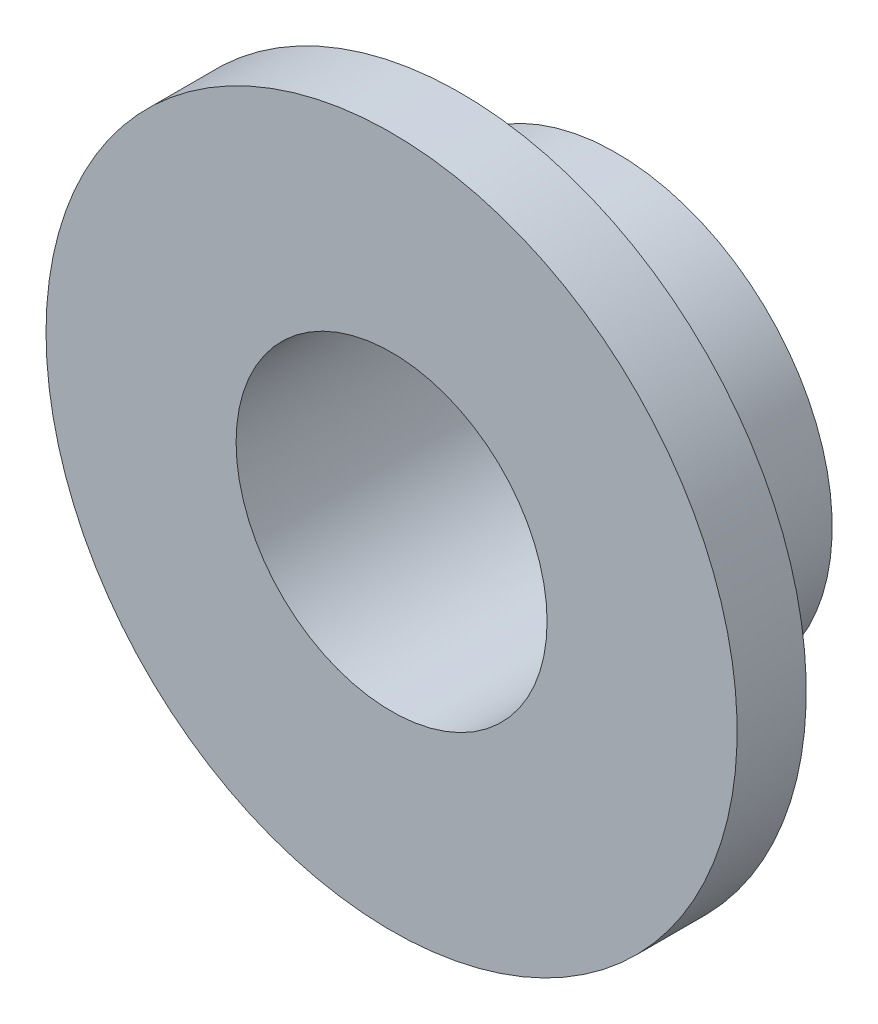
ISO-10303-21;
HEADER;
FILE_DESCRIPTION(('STEP AP214'),'2;1');
FILE_NAME('part.step','',(''),(''),'','','');
FILE_SCHEMA(('AUTOMOTIVE_DESIGN { 1 0 10303 214 1 1 1 1 }'));
ENDSEC;
DATA;
#1=APPLICATION_CONTEXT('core data for automotive mechanical design processes');
#2=APPLICATION_PROTOCOL_DEFINITION('international standard','automotive_design',2000,#1);
#3=PRODUCT_CONTEXT('',#1,'mechanical');
#4=PRODUCT('Part','Part','',(#3));
#5=PRODUCT_RELATED_PRODUCT_CATEGORY('part','',(#4));
#6=PRODUCT_DEFINITION_FORMATION('','',#4);
#7=PRODUCT_DEFINITION_CONTEXT('part definition',#1,'design');
#8=PRODUCT_DEFINITION('design','',#6,#7);
#9=PRODUCT_DEFINITION_SHAPE('','',#8);
#10=(LENGTH_UNIT() NAMED_UNIT(*) SI_UNIT(.MILLI.,.METRE.));
#11=(NAMED_UNIT(*) PLANE_ANGLE_UNIT() SI_UNIT($,.RADIAN.));
#12=(NAMED_UNIT(*) SI_UNIT($,.STERADIAN.) SOLID_ANGLE_UNIT());
#13=UNCERTAINTY_MEASURE_WITH_UNIT(LENGTH_MEASURE(1.E-05),#10,'distance_accuracy_value','');
#14=(GEOMETRIC_REPRESENTATION_CONTEXT(3) GLOBAL_UNCERTAINTY_ASSIGNED_CONTEXT((#13)) GLOBAL_UNIT_ASSIGNED_CONTEXT((#10,
#11,#12)) REPRESENTATION_CONTEXT('',''));
#15=CARTESIAN_POINT('',(0.,0.,0.));
#16=DIRECTION('',(0.,0.,1.));
#17=DIRECTION('',(1.,0.,0.));
#18=AXIS2_PLACEMENT_3D('',#15,#16,#17);
#19=CARTESIAN_POINT('',(0.,0.,-8.));
#20=DIRECTION('',(0.,0.,-1.));
#21=DIRECTION('',(-1.,0.,0.));
#22=AXIS2_PLACEMENT_3D('',#19,#20,#21);
#23=CYLINDRICAL_SURFACE('',#22,4.5);
#24=CARTESIAN_POINT('',(0.,0.,-4.));
#25=DIRECTION('',(0.,0.,-1.));
#26=DIRECTION('',(-1.,0.,0.));
#27=AXIS2_PLACEMENT_3D('',#24,#25,#26);
#28=CIRCLE('',#27,4.5);
#29=CARTESIAN_POINT('',(-4.5,0.,-4.));
#30=VERTEX_POINT('',#29);
#31=EDGE_CURVE('E10',#30,#30,#28,.T.);
#32=ORIENTED_EDGE('',*,*,#31,.T.);
#33=EDGE_LOOP('',(#32));
#34=FACE_BOUND('',#33,.T.);
#35=CARTESIAN_POINT('',(0.,0.,2.5));
#36=DIRECTION('',(0.,0.,-1.));
#37=DIRECTION('',(-1.,0.,0.));
#38=AXIS2_PLACEMENT_3D('',#35,#36,#37);
#39=CIRCLE('',#38,4.5);
#40=CARTESIAN_POINT('',(-4.5,0.,2.5));
#41=VERTEX_POINT('',#40);
#42=EDGE_CURVE('E55',#41,#41,#39,.T.);
#43=ORIENTED_EDGE('',*,*,#42,.F.);
#44=EDGE_LOOP('',(#43));
#45=FACE_BOUND('',#44,.T.);
#46=ADVANCED_FACE('F33',(#34,#45),#23,.F.);
#47=CARTESIAN_POINT('',(0.,4.50000000000003,-4.));
#48=DIRECTION('',(0.,0.,-1.));
#49=DIRECTION('',(-1.,0.,0.));
#50=AXIS2_PLACEMENT_3D('',#47,#48,#49);
#51=PLANE('',#50);
#52=CARTESIAN_POINT('',(0.,0.,-4.));
#53=DIRECTION('',(0.,0.,-1.));
#54=DIRECTION('',(-1.,0.,0.));
#55=AXIS2_PLACEMENT_3D('',#52,#53,#54);
#56=CIRCLE('',#55,6.25000000000001);
#57=CARTESIAN_POINT('',(-6.25000000000001,0.,-4.));
#58=VERTEX_POINT('',#57);
#59=EDGE_CURVE('E39',#58,#58,#56,.T.);
#60=ORIENTED_EDGE('',*,*,#59,.T.);
#61=EDGE_LOOP('',(#60));
#62=FACE_BOUND('',#61,.T.);
#63=ORIENTED_EDGE('',*,*,#31,.F.);
#64=EDGE_LOOP('',(#63));
#65=FACE_BOUND('',#64,.T.);
#66=ADVANCED_FACE('F63',(#62,#65),#51,.T.);
#67=CARTESIAN_POINT('',(0.,0.,-8.));
#68=DIRECTION('',(0.,0.,-1.));
#69=DIRECTION('',(-1.,0.,0.));
#70=AXIS2_PLACEMENT_3D('',#67,#68,#69);
#71=CYLINDRICAL_SURFACE('',#70,6.25000000000001);
#72=CARTESIAN_POINT('',(0.,0.,0.5));
#73=DIRECTION('',(0.,0.,-1.));
#74=DIRECTION('',(-1.,0.,0.));
#75=AXIS2_PLACEMENT_3D('',#72,#73,#74);
#76=CIRCLE('',#75,6.25);
#77=CARTESIAN_POINT('',(-6.25,0.,0.5));
#78=VERTEX_POINT('',#77);
#79=EDGE_CURVE('E43',#78,#78,#76,.T.);
#80=ORIENTED_EDGE('',*,*,#79,.T.);
#81=EDGE_LOOP('',(#80));
#82=FACE_BOUND('',#81,.T.);
#83=ORIENTED_EDGE('',*,*,#59,.F.);
#84=EDGE_LOOP('',(#83));
#85=FACE_BOUND('',#84,.T.);
#86=ADVANCED_FACE('F67',(#82,#85),#71,.T.);
#87=CARTESIAN_POINT('',(0.,6.25000000000003,0.5));
#88=DIRECTION('',(0.,0.,-1.));
#89=DIRECTION('',(-1.,0.,0.));
#90=AXIS2_PLACEMENT_3D('',#87,#88,#89);
#91=PLANE('',#90);
#92=CARTESIAN_POINT('',(0.,0.,0.5));
#93=DIRECTION('',(0.,0.,-1.));
#94=DIRECTION('',(-1.,0.,0.));
#95=AXIS2_PLACEMENT_3D('',#92,#93,#94);
#96=CIRCLE('',#95,9.99999999999997);
#97=CARTESIAN_POINT('',(-9.99999999999997,0.,0.5));
#98=VERTEX_POINT('',#97);
#99=EDGE_CURVE('E47',#98,#98,#96,.T.);
#100=ORIENTED_EDGE('',*,*,#99,.T.);
#101=EDGE_LOOP('',(#100));
#102=FACE_BOUND('',#101,.T.);
#103=ORIENTED_EDGE('',*,*,#79,.F.);
#104=EDGE_LOOP('',(#103));
#105=FACE_BOUND('',#104,.T.);
#106=ADVANCED_FACE('F71',(#102,#105),#91,.T.);
#107=CARTESIAN_POINT('',(0.,0.,-8.));
#108=DIRECTION('',(0.,0.,-1.));
#109=DIRECTION('',(-1.,0.,0.));
#110=AXIS2_PLACEMENT_3D('',#107,#108,#109);
#111=CYLINDRICAL_SURFACE('',#110,9.99999999999997);
#112=CARTESIAN_POINT('',(0.,0.,2.5));
#113=DIRECTION('',(0.,0.,-1.));
#114=DIRECTION('',(-1.,0.,0.));
#115=AXIS2_PLACEMENT_3D('',#112,#113,#114);
#116=CIRCLE('',#115,9.99999999999997);
#117=CARTESIAN_POINT('',(-9.99999999999997,0.,2.5));
#118=VERTEX_POINT('',#117);
#119=EDGE_CURVE('E52',#118,#118,#116,.T.);
#120=ORIENTED_EDGE('',*,*,#119,.T.);
#121=EDGE_LOOP('',(#120));
#122=FACE_BOUND('',#121,.T.);
#123=ORIENTED_EDGE('',*,*,#99,.F.);
#124=EDGE_LOOP('',(#123));
#125=FACE_BOUND('',#124,.T.);
#126=ADVANCED_FACE('F78',(#122,#125),#111,.T.);
#127=CARTESIAN_POINT('',(0.,10.,2.5));
#128=DIRECTION('',(0.,0.,1.));
#129=DIRECTION('',(1.,0.,0.));
#130=AXIS2_PLACEMENT_3D('',#127,#128,#129);
#131=PLANE('',#130);
#132=ORIENTED_EDGE('',*,*,#42,.T.);
#133=EDGE_LOOP('',(#132));
#134=FACE_BOUND('',#133,.T.);
#135=ORIENTED_EDGE('',*,*,#119,.F.);
#136=EDGE_LOOP('',(#135));
#137=FACE_BOUND('',#136,.T.);
#138=ADVANCED_FACE('F59',(#134,#137),#131,.T.);
#139=CLOSED_SHELL('',(#46,#66,#86,#106,#126,#138));
#140=MANIFOLD_SOLID_BREP('B2',#139);
#141=ADVANCED_BREP_SHAPE_REPRESENTATION('',(#18,#140),#14);
#142=SHAPE_DEFINITION_REPRESENTATION(#9,#141);
ENDSEC;
END-ISO-10303-21;
